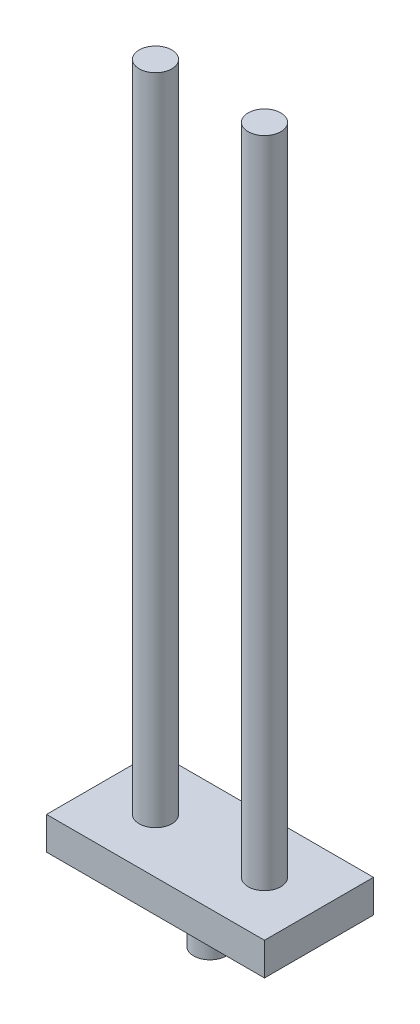
ISO-10303-21;
HEADER;
FILE_DESCRIPTION(('STEP AP214'),'2;1');
FILE_NAME('part.step','',(''),(''),'','','');
FILE_SCHEMA(('AUTOMOTIVE_DESIGN { 1 0 10303 214 1 1 1 1 }'));
ENDSEC;
DATA;
#1=APPLICATION_CONTEXT('core data for automotive mechanical design processes');
#2=APPLICATION_PROTOCOL_DEFINITION('international standard','automotive_design',2000,#1);
#3=PRODUCT_CONTEXT('',#1,'mechanical');
#4=PRODUCT('Part','Part','',(#3));
#5=PRODUCT_RELATED_PRODUCT_CATEGORY('part','',(#4));
#6=PRODUCT_DEFINITION_FORMATION('','',#4);
#7=PRODUCT_DEFINITION_CONTEXT('part definition',#1,'design');
#8=PRODUCT_DEFINITION('design','',#6,#7);
#9=PRODUCT_DEFINITION_SHAPE('','',#8);
#10=(LENGTH_UNIT() NAMED_UNIT(*) SI_UNIT(.MILLI.,.METRE.));
#11=(NAMED_UNIT(*) PLANE_ANGLE_UNIT() SI_UNIT($,.RADIAN.));
#12=(NAMED_UNIT(*) SI_UNIT($,.STERADIAN.) SOLID_ANGLE_UNIT());
#13=UNCERTAINTY_MEASURE_WITH_UNIT(LENGTH_MEASURE(1.E-05),#10,'distance_accuracy_value','');
#14=(GEOMETRIC_REPRESENTATION_CONTEXT(3) GLOBAL_UNCERTAINTY_ASSIGNED_CONTEXT((#13)) GLOBAL_UNIT_ASSIGNED_CONTEXT((#10,
#11,#12)) REPRESENTATION_CONTEXT('',''));
#15=CARTESIAN_POINT('',(0.,0.,0.));
#16=DIRECTION('',(0.,0.,1.));
#17=DIRECTION('',(1.,0.,0.));
#18=AXIS2_PLACEMENT_3D('',#15,#16,#17);
#19=CARTESIAN_POINT('',(10.,3.,-5.));
#20=DIRECTION('',(-1.,0.,0.));
#21=DIRECTION('',(0.,0.,1.));
#22=AXIS2_PLACEMENT_3D('',#19,#20,#21);
#23=PLANE('',#22);
#24=DIRECTION('',(0.,0.,-1.));
#25=VECTOR('',#24,1.);
#26=CARTESIAN_POINT('',(10.,0.,-5.));
#27=LINE('',#26,#25);
#28=CARTESIAN_POINT('',(10.,0.,5.));
#29=VERTEX_POINT('',#28);
#30=CARTESIAN_POINT('',(10.,0.,-5.));
#31=VERTEX_POINT('',#30);
#32=EDGE_CURVE('E104',#29,#31,#27,.T.);
#33=ORIENTED_EDGE('',*,*,#32,.T.);
#34=DIRECTION('',(0.,-1.,0.));
#35=VECTOR('',#34,1.);
#36=CARTESIAN_POINT('',(10.,3.,-5.));
#37=LINE('',#36,#35);
#38=CARTESIAN_POINT('',(10.,3.,-5.));
#39=VERTEX_POINT('',#38);
#40=EDGE_CURVE('E46',#39,#31,#37,.T.);
#41=ORIENTED_EDGE('',*,*,#40,.F.);
#42=DIRECTION('',(0.,0.,-1.));
#43=VECTOR('',#42,1.);
#44=CARTESIAN_POINT('',(10.,3.,-5.));
#45=LINE('',#44,#43);
#46=CARTESIAN_POINT('',(10.,3.,5.));
#47=VERTEX_POINT('',#46);
#48=EDGE_CURVE('E90',#47,#39,#45,.T.);
#49=ORIENTED_EDGE('',*,*,#48,.F.);
#50=DIRECTION('',(0.,-1.,0.));
#51=VECTOR('',#50,1.);
#52=CARTESIAN_POINT('',(10.,3.,5.));
#53=LINE('',#52,#51);
#54=EDGE_CURVE('E100',#47,#29,#53,.T.);
#55=ORIENTED_EDGE('',*,*,#54,.T.);
#56=EDGE_LOOP('',(#33,#41,#49,#55));
#57=FACE_BOUND('',#56,.T.);
#58=ADVANCED_FACE('F38',(#57),#23,.F.);
#59=CARTESIAN_POINT('',(-10.,3.,-5.));
#60=DIRECTION('',(0.,0.,1.));
#61=DIRECTION('',(1.,0.,0.));
#62=AXIS2_PLACEMENT_3D('',#59,#60,#61);
#63=PLANE('',#62);
#64=DIRECTION('',(-1.,0.,0.));
#65=VECTOR('',#64,1.);
#66=CARTESIAN_POINT('',(-10.,0.,-5.));
#67=LINE('',#66,#65);
#68=CARTESIAN_POINT('',(-10.,0.,-5.));
#69=VERTEX_POINT('',#68);
#70=EDGE_CURVE('E95',#31,#69,#67,.T.);
#71=ORIENTED_EDGE('',*,*,#70,.T.);
#72=DIRECTION('',(0.,-1.,0.));
#73=VECTOR('',#72,1.);
#74=CARTESIAN_POINT('',(-10.,3.,-5.));
#75=LINE('',#74,#73);
#76=CARTESIAN_POINT('',(-10.,3.,-5.));
#77=VERTEX_POINT('',#76);
#78=EDGE_CURVE('E93',#77,#69,#75,.T.);
#79=ORIENTED_EDGE('',*,*,#78,.F.);
#80=DIRECTION('',(-1.,0.,0.));
#81=VECTOR('',#80,1.);
#82=CARTESIAN_POINT('',(-10.,3.,-5.));
#83=LINE('',#82,#81);
#84=EDGE_CURVE('E85',#39,#77,#83,.T.);
#85=ORIENTED_EDGE('',*,*,#84,.F.);
#86=ORIENTED_EDGE('',*,*,#40,.T.);
#87=EDGE_LOOP('',(#71,#79,#85,#86));
#88=FACE_BOUND('',#87,.T.);
#89=ADVANCED_FACE('F94',(#88),#63,.F.);
#90=CARTESIAN_POINT('',(-10.,3.,-5.));
#91=DIRECTION('',(1.,0.,0.));
#92=DIRECTION('',(0.,0.,-1.));
#93=AXIS2_PLACEMENT_3D('',#90,#91,#92);
#94=PLANE('',#93);
#95=DIRECTION('',(0.,0.,1.));
#96=VECTOR('',#95,1.);
#97=CARTESIAN_POINT('',(-10.,0.,-5.));
#98=LINE('',#97,#96);
#99=CARTESIAN_POINT('',(-10.,0.,5.));
#100=VERTEX_POINT('',#99);
#101=EDGE_CURVE('E71',#69,#100,#98,.T.);
#102=ORIENTED_EDGE('',*,*,#101,.T.);
#103=DIRECTION('',(0.,-1.,0.));
#104=VECTOR('',#103,1.);
#105=CARTESIAN_POINT('',(-10.,3.,5.));
#106=LINE('',#105,#104);
#107=CARTESIAN_POINT('',(-10.,3.,5.));
#108=VERTEX_POINT('',#107);
#109=EDGE_CURVE('E96',#108,#100,#106,.T.);
#110=ORIENTED_EDGE('',*,*,#109,.F.);
#111=DIRECTION('',(0.,0.,1.));
#112=VECTOR('',#111,1.);
#113=CARTESIAN_POINT('',(-10.,3.,-5.));
#114=LINE('',#113,#112);
#115=EDGE_CURVE('E88',#77,#108,#114,.T.);
#116=ORIENTED_EDGE('',*,*,#115,.F.);
#117=ORIENTED_EDGE('',*,*,#78,.T.);
#118=EDGE_LOOP('',(#102,#110,#116,#117));
#119=FACE_BOUND('',#118,.T.);
#120=ADVANCED_FACE('F98',(#119),#94,.F.);
#121=CARTESIAN_POINT('',(-10.,3.,5.));
#122=DIRECTION('',(0.,0.,-1.));
#123=DIRECTION('',(-1.,0.,0.));
#124=AXIS2_PLACEMENT_3D('',#121,#122,#123);
#125=PLANE('',#124);
#126=DIRECTION('',(1.,0.,0.));
#127=VECTOR('',#126,1.);
#128=CARTESIAN_POINT('',(-10.,0.,5.));
#129=LINE('',#128,#127);
#130=EDGE_CURVE('E77',#100,#29,#129,.T.);
#131=ORIENTED_EDGE('',*,*,#130,.T.);
#132=ORIENTED_EDGE('',*,*,#54,.F.);
#133=DIRECTION('',(1.,0.,0.));
#134=VECTOR('',#133,1.);
#135=CARTESIAN_POINT('',(-10.,3.,5.));
#136=LINE('',#135,#134);
#137=EDGE_CURVE('E54',#108,#47,#136,.T.);
#138=ORIENTED_EDGE('',*,*,#137,.F.);
#139=ORIENTED_EDGE('',*,*,#109,.T.);
#140=EDGE_LOOP('',(#131,#132,#138,#139));
#141=FACE_BOUND('',#140,.T.);
#142=ADVANCED_FACE('F127',(#141),#125,.F.);
#143=CARTESIAN_POINT('',(0.,3.,0.));
#144=DIRECTION('',(0.,1.,0.));
#145=DIRECTION('',(0.,0.,1.));
#146=AXIS2_PLACEMENT_3D('',#143,#144,#145);
#147=PLANE('',#146);
#148=CARTESIAN_POINT('',(5.,3.,0.));
#149=DIRECTION('',(0.,1.,0.));
#150=DIRECTION('',(0.,0.,-1.));
#151=AXIS2_PLACEMENT_3D('',#148,#149,#150);
#152=CIRCLE('',#151,1.5);
#153=CARTESIAN_POINT('',(5.,3.,-1.5));
#154=VERTEX_POINT('',#153);
#155=EDGE_CURVE('E217',#154,#154,#152,.T.);
#156=ORIENTED_EDGE('',*,*,#155,.F.);
#157=EDGE_LOOP('',(#156));
#158=FACE_BOUND('',#157,.T.);
#159=CARTESIAN_POINT('',(-5.,3.,0.));
#160=DIRECTION('',(0.,1.,0.));
#161=DIRECTION('',(0.,0.,1.));
#162=AXIS2_PLACEMENT_3D('',#159,#160,#161);
#163=CIRCLE('',#162,1.5);
#164=CARTESIAN_POINT('',(-5.,3.,1.5));
#165=VERTEX_POINT('',#164);
#166=EDGE_CURVE('E224',#165,#165,#163,.T.);
#167=ORIENTED_EDGE('',*,*,#166,.F.);
#168=EDGE_LOOP('',(#167));
#169=FACE_BOUND('',#168,.T.);
#170=ORIENTED_EDGE('',*,*,#48,.T.);
#171=ORIENTED_EDGE('',*,*,#84,.T.);
#172=ORIENTED_EDGE('',*,*,#115,.T.);
#173=ORIENTED_EDGE('',*,*,#137,.T.);
#174=EDGE_LOOP('',(#170,#171,#172,#173));
#175=FACE_BOUND('',#174,.T.);
#176=ADVANCED_FACE('F86',(#158,#169,#175),#147,.T.);
#177=CARTESIAN_POINT('',(0.,0.,0.));
#178=DIRECTION('',(0.,1.,0.));
#179=DIRECTION('',(0.,0.,1.));
#180=AXIS2_PLACEMENT_3D('',#177,#178,#179);
#181=PLANE('',#180);
#182=CARTESIAN_POINT('',(0.,0.,0.));
#183=DIRECTION('',(0.,1.,0.));
#184=DIRECTION('',(0.,0.,1.));
#185=AXIS2_PLACEMENT_3D('',#182,#183,#184);
#186=CIRCLE('',#185,1.5);
#187=CARTESIAN_POINT('',(0.,0.,1.5));
#188=VERTEX_POINT('',#187);
#189=EDGE_CURVE('E11',#188,#188,#186,.F.);
#190=ORIENTED_EDGE('',*,*,#189,.F.);
#191=EDGE_LOOP('',(#190));
#192=FACE_BOUND('',#191,.T.);
#193=ORIENTED_EDGE('',*,*,#32,.F.);
#194=ORIENTED_EDGE('',*,*,#130,.F.);
#195=ORIENTED_EDGE('',*,*,#101,.F.);
#196=ORIENTED_EDGE('',*,*,#70,.F.);
#197=EDGE_LOOP('',(#193,#194,#195,#196));
#198=FACE_BOUND('',#197,.T.);
#199=ADVANCED_FACE('F115',(#192,#198),#181,.F.);
#200=CARTESIAN_POINT('',(-5.,63.,0.));
#201=DIRECTION('',(0.,-1.,0.));
#202=DIRECTION('',(0.,0.,-1.));
#203=AXIS2_PLACEMENT_3D('',#200,#201,#202);
#204=CYLINDRICAL_SURFACE('',#203,1.5);
#205=CARTESIAN_POINT('',(-5.,63.,0.));
#206=DIRECTION('',(0.,1.,0.));
#207=DIRECTION('',(0.,0.,1.));
#208=AXIS2_PLACEMENT_3D('',#205,#206,#207);
#209=CIRCLE('',#208,1.5);
#210=CARTESIAN_POINT('',(-5.,63.,1.5));
#211=VERTEX_POINT('',#210);
#212=EDGE_CURVE('E107',#211,#211,#209,.T.);
#213=ORIENTED_EDGE('',*,*,#212,.F.);
#214=EDGE_LOOP('',(#213));
#215=FACE_BOUND('',#214,.T.);
#216=ORIENTED_EDGE('',*,*,#166,.T.);
#217=EDGE_LOOP('',(#216));
#218=FACE_BOUND('',#217,.T.);
#219=ADVANCED_FACE('F117',(#215,#218),#204,.T.);
#220=CARTESIAN_POINT('',(-5.,63.,0.));
#221=DIRECTION('',(0.,1.,0.));
#222=DIRECTION('',(0.,0.,1.));
#223=AXIS2_PLACEMENT_3D('',#220,#221,#222);
#224=PLANE('',#223);
#225=ORIENTED_EDGE('',*,*,#212,.T.);
#226=EDGE_LOOP('',(#225));
#227=FACE_BOUND('',#226,.T.);
#228=ADVANCED_FACE('F124',(#227),#224,.T.);
#229=CARTESIAN_POINT('',(5.,63.,0.));
#230=DIRECTION('',(0.,-1.,0.));
#231=DIRECTION('',(0.,0.,-1.));
#232=AXIS2_PLACEMENT_3D('',#229,#230,#231);
#233=CYLINDRICAL_SURFACE('',#232,1.5);
#234=CARTESIAN_POINT('',(5.,63.,0.));
#235=DIRECTION('',(0.,1.,0.));
#236=DIRECTION('',(0.,0.,-1.));
#237=AXIS2_PLACEMENT_3D('',#234,#235,#236);
#238=CIRCLE('',#237,1.5);
#239=CARTESIAN_POINT('',(5.,63.,-1.5));
#240=VERTEX_POINT('',#239);
#241=EDGE_CURVE('E220',#240,#240,#238,.T.);
#242=ORIENTED_EDGE('',*,*,#241,.F.);
#243=EDGE_LOOP('',(#242));
#244=FACE_BOUND('',#243,.T.);
#245=ORIENTED_EDGE('',*,*,#155,.T.);
#246=EDGE_LOOP('',(#245));
#247=FACE_BOUND('',#246,.T.);
#248=ADVANCED_FACE('F166',(#244,#247),#233,.T.);
#249=CARTESIAN_POINT('',(5.,63.,0.));
#250=DIRECTION('',(0.,-1.,0.));
#251=DIRECTION('',(0.,0.,-1.));
#252=AXIS2_PLACEMENT_3D('',#249,#250,#251);
#253=PLANE('',#252);
#254=ORIENTED_EDGE('',*,*,#241,.T.);
#255=EDGE_LOOP('',(#254));
#256=FACE_BOUND('',#255,.T.);
#257=ADVANCED_FACE('F177',(#256),#253,.F.);
#258=CARTESIAN_POINT('',(0.,-5.,0.));
#259=DIRECTION('',(0.,1.,0.));
#260=DIRECTION('',(0.,0.,1.));
#261=AXIS2_PLACEMENT_3D('',#258,#259,#260);
#262=CYLINDRICAL_SURFACE('',#261,1.5);
#263=CARTESIAN_POINT('',(0.,-5.,0.));
#264=DIRECTION('',(0.,-1.,0.));
#265=DIRECTION('',(0.,0.,-1.));
#266=AXIS2_PLACEMENT_3D('',#263,#264,#265);
#267=CIRCLE('',#266,1.5);
#268=CARTESIAN_POINT('',(0.,-5.,-1.5));
#269=VERTEX_POINT('',#268);
#270=EDGE_CURVE('E216',#269,#269,#267,.T.);
#271=ORIENTED_EDGE('',*,*,#270,.F.);
#272=EDGE_LOOP('',(#271));
#273=FACE_BOUND('',#272,.T.);
#274=ORIENTED_EDGE('',*,*,#189,.T.);
#275=EDGE_LOOP('',(#274));
#276=FACE_BOUND('',#275,.T.);
#277=ADVANCED_FACE('F186',(#273,#276),#262,.T.);
#278=CARTESIAN_POINT('',(0.,-5.,0.));
#279=DIRECTION('',(0.,-1.,0.));
#280=DIRECTION('',(0.,0.,-1.));
#281=AXIS2_PLACEMENT_3D('',#278,#279,#280);
#282=PLANE('',#281);
#283=ORIENTED_EDGE('',*,*,#270,.T.);
#284=EDGE_LOOP('',(#283));
#285=FACE_BOUND('',#284,.T.);
#286=ADVANCED_FACE('F200',(#285),#282,.T.);
#287=CLOSED_SHELL('',(#58,#89,#120,#142,#176,#199,#219,#228,#248,#257,#277,#286));
#288=MANIFOLD_SOLID_BREP('B2',#287);
#289=ADVANCED_BREP_SHAPE_REPRESENTATION('',(#18,#288),#14);
#290=SHAPE_DEFINITION_REPRESENTATION(#9,#289);
ENDSEC;
END-ISO-10303-21;
